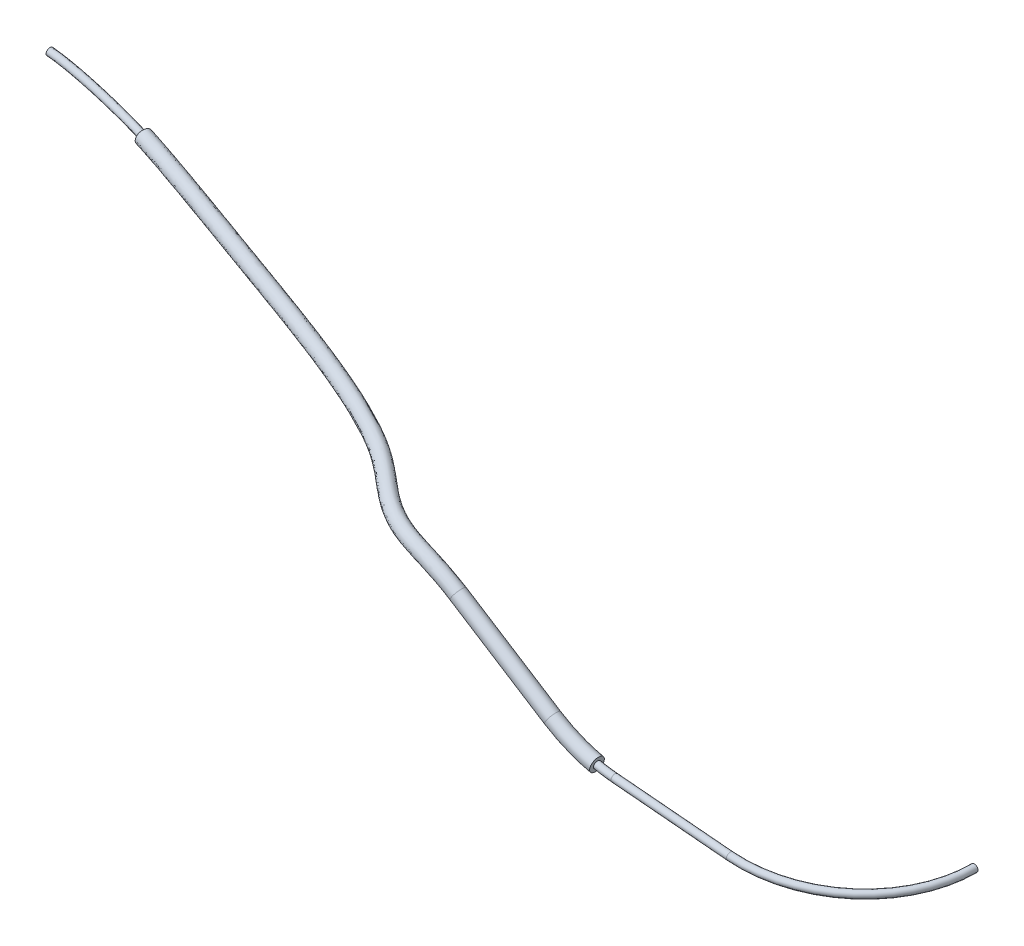
ISO-10303-21;
HEADER;
FILE_DESCRIPTION(('STEP AP214'),'2;1');
FILE_NAME('part.step','',(''),(''),'','','');
FILE_SCHEMA(('AUTOMOTIVE_DESIGN { 1 0 10303 214 1 1 1 1 }'));
ENDSEC;
DATA;
#1=APPLICATION_CONTEXT('core data for automotive mechanical design processes');
#2=APPLICATION_PROTOCOL_DEFINITION('international standard','automotive_design',2000,#1);
#3=PRODUCT_CONTEXT('',#1,'mechanical');
#4=PRODUCT('Part','Part','',(#3));
#5=PRODUCT_RELATED_PRODUCT_CATEGORY('part','',(#4));
#6=PRODUCT_DEFINITION_FORMATION('','',#4);
#7=PRODUCT_DEFINITION_CONTEXT('part definition',#1,'design');
#8=PRODUCT_DEFINITION('design','',#6,#7);
#9=PRODUCT_DEFINITION_SHAPE('','',#8);
#10=(LENGTH_UNIT() NAMED_UNIT(*) SI_UNIT(.MILLI.,.METRE.));
#11=(NAMED_UNIT(*) PLANE_ANGLE_UNIT() SI_UNIT($,.RADIAN.));
#12=(NAMED_UNIT(*) SI_UNIT($,.STERADIAN.) SOLID_ANGLE_UNIT());
#13=UNCERTAINTY_MEASURE_WITH_UNIT(LENGTH_MEASURE(1.E-05),#10,'distance_accuracy_value','');
#14=(GEOMETRIC_REPRESENTATION_CONTEXT(3) GLOBAL_UNCERTAINTY_ASSIGNED_CONTEXT((#13)) GLOBAL_UNIT_ASSIGNED_CONTEXT((#10,
#11,#12)) REPRESENTATION_CONTEXT('',''));
#15=CARTESIAN_POINT('',(0.,0.,0.));
#16=DIRECTION('',(0.,0.,1.));
#17=DIRECTION('',(1.,0.,0.));
#18=AXIS2_PLACEMENT_3D('',#15,#16,#17);
#19=CARTESIAN_POINT('',(-31.2200938866293,22.7983679550577,16.3986439295386));
#20=DIRECTION('',(0.00262026090951332,0.0299534145210183,0.999547861380984));
#21=DIRECTION('',(0.,-0.999551292730131,0.0299535173481338));
#22=AXIS2_PLACEMENT_3D('',#19,#20,#21);
#23=TOROIDAL_SURFACE('',#22,20.,0.5);
#24=CARTESIAN_POINT('',(-35.4178961931824,3.25297513295508,16.9953643203384));
#25=DIRECTION('',(-0.977721470420134,0.209873394056464,-0.00372622418963117));
#26=DIRECTION('',(-0.209874851091096,-0.977728258198304,0.));
#27=AXIS2_PLACEMENT_3D('',#24,#25,#26);
#28=CIRCLE('',#27,0.5);
#29=CARTESIAN_POINT('',(-35.5228412508463,2.76434031240252,17.0102823301084));
#30=VERTEX_POINT('',#29);
#31=EDGE_CURVE('E13',#30,#30,#28,.T.);
#32=CARTESIAN_POINT('',(-32.9622072979749,2.88346369371292,17.));
#33=DIRECTION('',(-0.996195631584374,0.0871450722198903,0.));
#34=DIRECTION('',(0.00759426361221224,0.0868135402595565,0.996195631584374));
#35=AXIS2_PLACEMENT_3D('',#32,#33,#34);
#36=CIRCLE('',#35,0.5);
#37=CARTESIAN_POINT('',(-33.0057601332586,2.3855910871793,17.0150339017616));
#38=VERTEX_POINT('',#37);
#39=EDGE_CURVE('E87',#38,#38,#36,.T.);
#40=CARTESIAN_POINT('',(-31.2200938866293,22.7983679550577,16.3986439295386));
#41=DIRECTION('',(0.00262026090951332,0.0299534145210183,0.999547861380984));
#42=DIRECTION('',(0.,-0.999551292730131,0.0299535173481338));
#43=AXIS2_PLACEMENT_3D('',#40,#41,#42);
#44=CIRCLE('',#43,20.5);
#45=EDGE_CURVE('',#30,#38,#44,.T.);
#46=ORIENTED_EDGE('',*,*,#31,.F.);
#47=ORIENTED_EDGE('',*,*,#39,.T.);
#48=ORIENTED_EDGE('',*,*,#45,.T.);
#49=ORIENTED_EDGE('',*,*,#45,.F.);
#50=EDGE_LOOP('',(#46,#48,#47,#49));
#51=FACE_BOUND('',#50,.T.);
#52=ADVANCED_FACE('F44',(#51),#23,.T.);
#53=CARTESIAN_POINT('',(0.,0.,0.));
#54=DIRECTION('',(0.,0.,1.));
#55=DIRECTION('',(1.,0.,0.));
#56=AXIS2_PLACEMENT_3D('',#53,#54,#55);
#57=PLANE('',#56);
#58=CARTESIAN_POINT('',(0.,0.,0.));
#59=DIRECTION('',(0.,0.,1.));
#60=DIRECTION('',(1.,0.,0.));
#61=AXIS2_PLACEMENT_3D('',#58,#59,#60);
#62=CIRCLE('',#61,0.5);
#63=CARTESIAN_POINT('',(0.5,0.,0.));
#64=VERTEX_POINT('',#63);
#65=EDGE_CURVE('E57',#64,#64,#62,.T.);
#66=ORIENTED_EDGE('',*,*,#65,.F.);
#67=EDGE_LOOP('',(#66));
#68=FACE_BOUND('',#67,.T.);
#69=ADVANCED_FACE('F108',(#68),#57,.F.);
#70=CARTESIAN_POINT('',(-32.9622072979749,2.88346369371292,17.));
#71=DIRECTION('',(0.996195631584374,-0.0871450722198892,0.));
#72=DIRECTION('',(0.0871450722198892,0.996195631584374,0.));
#73=AXIS2_PLACEMENT_3D('',#70,#71,#72);
#74=CYLINDRICAL_SURFACE('',#73,0.5);
#75=CARTESIAN_POINT('',(-16.9353257369343,1.48146622773808,17.));
#76=DIRECTION('',(-0.996195631584374,0.0871450722198898,0.));
#77=DIRECTION('',(0.00759426361221275,0.0868135402595565,0.996195631584374));
#78=AXIS2_PLACEMENT_3D('',#75,#76,#77);
#79=CIRCLE('',#78,0.5);
#80=CARTESIAN_POINT('',(-16.9315286051282,1.52487299786786,17.4980978157922));
#81=VERTEX_POINT('',#80);
#82=EDGE_CURVE('E90',#81,#81,#79,.T.);
#83=ORIENTED_EDGE('',*,*,#82,.T.);
#84=EDGE_LOOP('',(#83));
#85=FACE_BOUND('',#84,.T.);
#86=ORIENTED_EDGE('',*,*,#39,.F.);
#87=EDGE_LOOP('',(#86));
#88=FACE_BOUND('',#87,.T.);
#89=ADVANCED_FACE('F95',(#85,#88),#74,.T.);
#90=CARTESIAN_POINT('',(-16.9353257369344,1.4814662277381,0.));
#91=DIRECTION('',(0.0871450722198882,0.996195631584374,0.));
#92=DIRECTION('',(-0.996195631584374,0.0871450722198882,0.));
#93=AXIS2_PLACEMENT_3D('',#90,#91,#92);
#94=TOROIDAL_SURFACE('',#93,17.,0.5);
#95=ORIENTED_EDGE('',*,*,#65,.T.);
#96=EDGE_LOOP('',(#95));
#97=FACE_BOUND('',#96,.T.);
#98=ORIENTED_EDGE('',*,*,#82,.F.);
#99=EDGE_LOOP('',(#98));
#100=FACE_BOUND('',#99,.T.);
#101=ADVANCED_FACE('F98',(#97,#100),#94,.T.);
#102=CARTESIAN_POINT('',(-119.382838313861,26.2426936084585,-4.02926946825118));
#103=DIRECTION('',(-0.969669931296822,0.138175246355401,-0.201613059183773));
#104=DIRECTION('',(-0.15207214483386,-0.986833741600424,0.0550747601405472));
#105=AXIS2_PLACEMENT_3D('',#102,#103,#104);
#106=PLANE('',#105);
#107=CARTESIAN_POINT('',(-119.382838313861,26.2426936084585,-4.02926946825118));
#108=DIRECTION('',(-0.969669931296822,0.138175246355401,-0.201613059183773));
#109=DIRECTION('',(-0.15207214483386,-0.986833741600424,0.0550747601405472));
#110=AXIS2_PLACEMENT_3D('',#107,#108,#109);
#111=CIRCLE('',#110,1.);
#112=CARTESIAN_POINT('',(-119.534910458695,25.2558598668581,-3.97419470811064));
#113=VERTEX_POINT('',#112);
#114=EDGE_CURVE('E156',#113,#113,#111,.T.);
#115=ORIENTED_EDGE('',*,*,#114,.T.);
#116=EDGE_LOOP('',(#115));
#117=FACE_BOUND('',#116,.T.);
#118=CARTESIAN_POINT('',(-119.471544187037,26.3274949897696,-3.54451480784439));
#119=CARTESIAN_POINT('',(-119.466819369843,26.354921803188,-3.54844216499339));
#120=CARTESIAN_POINT('',(-119.461675585093,26.3819275043064,-3.5546731811375));
#121=CARTESIAN_POINT('',(-119.45068377419,26.4344100960731,-3.5715700709377));
#122=CARTESIAN_POINT('',(-119.444834907974,26.4598851077805,-3.58224127264824));
#123=CARTESIAN_POINT('',(-119.432609350133,26.5085190206295,-3.60770962732206));
#124=CARTESIAN_POINT('',(-119.426232984675,26.531679333736,-3.62250424387579));
#125=CARTESIAN_POINT('',(-119.413129720267,26.5750482607951,-3.65580233159247));
#126=CARTESIAN_POINT('',(-119.406402811111,26.5952567887415,-3.67430591078638));
#127=CARTESIAN_POINT('',(-119.392790167808,26.632145442347,-3.71449513328228));
#128=CARTESIAN_POINT('',(-119.385904444045,26.6488257979695,-3.73618056903729));
#129=CARTESIAN_POINT('',(-119.372168897185,26.6781871480263,-3.78211973111737));
#130=CARTESIAN_POINT('',(-119.365319075505,26.6908679858227,-3.8063735579817));
#131=CARTESIAN_POINT('',(-119.351854716693,26.7118622165262,-3.85674281940411));
#132=CARTESIAN_POINT('',(-119.345240021433,26.7201785985036,-3.88285696593387));
#133=CARTESIAN_POINT('',(-119.332419861928,26.7322295860784,-3.93625715267427));
#134=CARTESIAN_POINT('',(-119.326214955476,26.735958063626,-3.96354470999732));
#135=CARTESIAN_POINT('',(-119.314404247837,26.7387061779324,-4.0184655903126));
#136=CARTESIAN_POINT('',(-119.308798063321,26.7377288462608,-4.04609867926421));
#137=CARTESIAN_POINT('',(-119.298339044967,26.7311000986791,-4.10094495005926));
#138=CARTESIAN_POINT('',(-119.293486245517,26.7254484694733,-4.12815811268307));
#139=CARTESIAN_POINT('',(-119.284671938635,26.7096312674814,-4.18139134159192));
#140=CARTESIAN_POINT('',(-119.280710448605,26.699465606571,-4.20741138457357));
#141=CARTESIAN_POINT('',(-119.273791096865,26.6749082681593,-4.2575207557243));
#142=CARTESIAN_POINT('',(-119.270833290084,26.6605163594461,-4.28160997816911));
#143=CARTESIAN_POINT('',(-119.266007061894,26.6279257143268,-4.3271579640635));
#144=CARTESIAN_POINT('',(-119.264137955619,26.6097293809711,-4.34861837448645));
#145=CARTESIAN_POINT('',(-119.261537472244,26.5700135490356,-4.38834474652832));
#146=CARTESIAN_POINT('',(-119.2608076156,26.5484896514554,-4.40660641027116));
#147=CARTESIAN_POINT('',(-119.260511357879,26.5027790526376,-4.43935897840025));
#148=CARTESIAN_POINT('',(-119.260943403508,26.4785959478396,-4.45385488863163));
#149=CARTESIAN_POINT('',(-119.262956838061,26.4281932944349,-4.4787145486475));
#150=CARTESIAN_POINT('',(-119.264539838437,26.4019709366881,-4.48907247329993));
#151=CARTESIAN_POINT('',(-119.268808680312,26.3483070305193,-4.50531971373629));
#152=CARTESIAN_POINT('',(-119.271492808363,26.3208674351252,-4.51121593194483));
#153=CARTESIAN_POINT('',(-119.277893125098,26.2654623317883,-4.51840504519309));
#154=CARTESIAN_POINT('',(-119.281611028283,26.2374960227575,-4.51969024326083));
#155=CARTESIAN_POINT('',(-119.289971057183,26.1818791910654,-4.5175991127017));
#156=CARTESIAN_POINT('',(-119.294613131061,26.1542286507843,-4.51422304546823));
#157=CARTESIAN_POINT('',(-119.30468119411,26.1000734617112,-4.50291528880637));
#158=CARTESIAN_POINT('',(-119.310105863971,26.0735669800531,-4.49499120082707));
#159=CARTESIAN_POINT('',(-119.321599650403,26.022364528982,-4.47480268811178));
#160=CARTESIAN_POINT('',(-119.327669699377,25.9976712686528,-4.46253192225888));
#161=CARTESIAN_POINT('',(-119.340266195625,25.9508734914073,-4.4340211240222));
#162=CARTESIAN_POINT('',(-119.346791991453,25.9287653954936,-4.41778667767611));
#163=CARTESIAN_POINT('',(-119.360131370921,25.8876974523074,-4.38177600438243));
#164=CARTESIAN_POINT('',(-119.366945321246,25.8687417776064,-4.36199515418336));
#165=CARTESIAN_POINT('',(-119.380650055097,25.834575896167,-4.31949696839705));
#166=CARTESIAN_POINT('',(-119.387540724238,25.8193607359525,-4.29678357780287));
#167=CARTESIAN_POINT('',(-119.401217176634,25.793065350427,-4.24902737926552));
#168=CARTESIAN_POINT('',(-119.408002885458,25.7819879410738,-4.22398299938842));
#169=CARTESIAN_POINT('',(-119.421271596559,25.7642975762442,-4.17229041704457));
#170=CARTESIAN_POINT('',(-119.42775461523,25.7576843787291,-4.14564230161385));
#171=CARTESIAN_POINT('',(-119.440234871558,25.749108651457,-4.09149513420322));
#172=CARTESIAN_POINT('',(-119.446232069472,25.7471465018162,-4.06399601285919));
#173=CARTESIAN_POINT('',(-119.457569616883,25.747929482132,-4.00893079356103));
#174=CARTESIAN_POINT('',(-119.462909995557,25.7506744029114,-3.98136469863748));
#175=CARTESIAN_POINT('',(-119.472786421681,25.7607969281413,-3.92692598369083));
#176=CARTESIAN_POINT('',(-119.477321859957,25.7681780222036,-3.90005390192242));
#177=CARTESIAN_POINT('',(-119.485449131303,25.7873532241589,-3.84782361017474));
#178=CARTESIAN_POINT('',(-119.48904221294,25.7991414420967,-3.82246343181022));
#179=CARTESIAN_POINT('',(-119.495193234415,25.8268082147489,-3.77391834381643));
#180=CARTESIAN_POINT('',(-119.497750390223,25.8426898527132,-3.75073509193046));
#181=CARTESIAN_POINT('',(-119.501753006265,25.8780875007022,-3.70722454162825));
#182=CARTESIAN_POINT('',(-119.503198509807,25.8976033691044,-3.68689713197662));
#183=CARTESIAN_POINT('',(-119.504936992328,25.9397178476323,-3.64967269471282));
#184=CARTESIAN_POINT('',(-119.505229882359,25.9623166955345,-3.63277593194143));
#185=CARTESIAN_POINT('',(-119.504654744714,26.0099528356016,-3.60289472419443));
#186=CARTESIAN_POINT('',(-119.503786751204,26.0349900559836,-3.5899101640941));
#187=CARTESIAN_POINT('',(-119.500913006432,26.0868122030304,-3.56821536879232));
#188=CARTESIAN_POINT('',(-119.498906556303,26.1135981942691,-3.55950776522326));
#189=CARTESIAN_POINT('',(-119.493817782049,26.1680973086232,-3.54663162940509));
#190=CARTESIAN_POINT('',(-119.490736755074,26.1958092776626,-3.54245764938475));
#191=CARTESIAN_POINT('',(-119.482688462076,26.2583573320057,-3.53829916251339));
#192=CARTESIAN_POINT('',(-119.477442825072,26.2932543327975,-3.53961174867761));
#193=CARTESIAN_POINT('',(-119.471544187037,26.3274949897696,-3.54451480784439));
#194=B_SPLINE_CURVE_WITH_KNOTS('',3,(#118,#119,#120,#121,#122,#123,#124,#125,#126,#127,#128,
#129,#130,#131,#132,#133,#134,#135,#136,#137,#138,#139,#140,#141,#142,#143,#144,#145,#146,#147,
#148,#149,#150,#151,#152,#153,#154,#155,#156,#157,#158,#159,#160,#161,#162,#163,#164,#165,#166,
#167,#168,#169,#170,#171,#172,#173,#174,#175,#176,#177,#178,#179,#180,#181,#182,#183,#184,#185,
#186,#187,#188,#189,#190,#191,#192,#193),.UNSPECIFIED.,.T.,.F.,(4,2,2,2,2,2,2,2,2,2,2,2,2,2,2,2,
2,2,2,2,2,2,2,2,2,2,2,2,2,2,2,2,2,2,2,2,2,4),(0.,0.0841885324125921,0.16847838055267,
0.252716494021672,0.336957061450593,0.421192136454235,0.505430510046022,0.589611116043435,
0.673904040187835,0.758142668532792,0.842385141032538,0.926629258210851,1.01087798512468,
1.09507365655716,1.17938160077394,1.26357689358975,1.34789029579714,1.43207299387702,
1.51639614920164,1.60071457606351,1.68489248389278,1.76919370320143,1.85337679523087,
1.93767044086111,2.02185184968721,2.10609044447446,2.19032447167993,2.27456538284256,
2.35880255052645,2.44310319897954,2.52729158321772,2.61154356617685,2.69579226660101,
2.78004746842764,2.86430019062729,2.94860468920082,3.03280777188533,3.13791187622867),.UNSPECIFIED.);
#195=CARTESIAN_POINT('',(-119.471544187037,26.3274949897696,-3.54451480784439));
#196=VERTEX_POINT('',#195);
#197=EDGE_CURVE('E48',#196,#196,#194,.T.);
#198=ORIENTED_EDGE('',*,*,#197,.F.);
#199=EDGE_LOOP('',(#198));
#200=FACE_BOUND('',#199,.T.);
#201=ADVANCED_FACE('F100',(#117,#200),#106,.T.);
#202=CARTESIAN_POINT('',(-35.4178961931824,3.2529751329551,16.9953643203384));
#203=DIRECTION('',(-0.977721470420134,0.209873394056464,-0.00372622418963117));
#204=DIRECTION('',(-0.209874851091096,-0.977728258198304,0.));
#205=AXIS2_PLACEMENT_3D('',#202,#203,#204);
#206=PLANE('',#205);
#207=ORIENTED_EDGE('',*,*,#31,.T.);
#208=EDGE_LOOP('',(#207));
#209=FACE_BOUND('',#208,.T.);
#210=CARTESIAN_POINT('',(-35.4178961931824,3.2529751329551,16.9953643203384));
#211=DIRECTION('',(-0.977721470420134,0.209873394056464,-0.00372622418963117));
#212=DIRECTION('',(-0.209874851091096,-0.977728258198304,0.));
#213=AXIS2_PLACEMENT_3D('',#210,#211,#212);
#214=CIRCLE('',#213,1.);
#215=CARTESIAN_POINT('',(-35.6277710442735,2.2752468747568,16.9953643203384));
#216=VERTEX_POINT('',#215);
#217=EDGE_CURVE('E74',#216,#216,#214,.T.);
#218=ORIENTED_EDGE('',*,*,#217,.F.);
#219=EDGE_LOOP('',(#218));
#220=FACE_BOUND('',#219,.T.);
#221=ADVANCED_FACE('F106',(#209,#220),#206,.F.);
#222=CARTESIAN_POINT('',(-119.534910458695,25.2558598668581,-3.97419470811064));
#223=CARTESIAN_POINT('',(-118.180302410872,25.0628320216093,-3.69254559508604));
#224=CARTESIAN_POINT('',(-116.911292621239,24.9369085907261,-3.34918953168654));
#225=CARTESIAN_POINT('',(-110.675074357738,24.1668910099001,-1.72074700575621));
#226=CARTESIAN_POINT('',(-105.771969511182,23.0492481770787,-0.638934317897517));
#227=CARTESIAN_POINT('',(-95.091437049037,21.148016130084,1.99139766645636));
#228=CARTESIAN_POINT('',(-89.9090718959783,20.3636994157694,3.33908869053257));
#229=CARTESIAN_POINT('',(-80.3876932564328,18.9440091989967,6.35829094113684));
#230=CARTESIAN_POINT('',(-76.0563064818123,18.3082291308345,8.03359684755067));
#231=CARTESIAN_POINT('',(-71.1366114590035,17.4428302986262,10.9809667551709));
#232=CARTESIAN_POINT('',(-69.771685333553,17.1437594227626,12.2272867416542));
#233=CARTESIAN_POINT('',(-66.9086693337093,16.4911890997607,14.3917950398208));
#234=CARTESIAN_POINT('',(-65.4032279331163,16.1363823297736,15.3091411323341));
#235=CARTESIAN_POINT('',(-62.0982172723952,15.4527906076739,16.1831389071892));
#236=CARTESIAN_POINT('',(-60.8141449680491,15.1958142125213,16.3804120865357));
#237=CARTESIAN_POINT('',(-58.8261726902079,14.5863001042488,16.5765391338112));
#238=CARTESIAN_POINT('',(-58.1534622251063,14.3464034471726,16.6248283995411));
#239=CARTESIAN_POINT('',(-57.1468396259899,13.9115447451276,16.6767364353093));
#240=CARTESIAN_POINT('',(-56.8116891644714,13.7541165254987,16.690615168137));
#241=CARTESIAN_POINT('',(-56.1447322803402,13.4111915675095,16.7123087937121));
#242=CARTESIAN_POINT('',(-55.8238137842896,13.2323532128478,16.7199559508013));
#243=CARTESIAN_POINT('',(-55.483901205373,13.0246105238328,16.7252903059039));
#244=CARTESIAN_POINT('',(-119.917607660694,25.4239880052946,-2.01836348312007));
#245=CARTESIAN_POINT('',(-118.639183550315,25.2418161572029,-1.75255447886542));
#246=CARTESIAN_POINT('',(-117.40769273179,25.1194379544474,-1.4203336625501));
#247=CARTESIAN_POINT('',(-111.100588295099,24.3406679520785,0.226619103931146));
#248=CARTESIAN_POINT('',(-106.189361009612,23.2198144685338,1.30981888454054));
#249=CARTESIAN_POINT('',(-95.5599284239121,21.3276786737438,3.92756632331056));
#250=CARTESIAN_POINT('',(-90.4140366250851,20.5491416339808,5.26681603951933));
#251=CARTESIAN_POINT('',(-81.0327752510644,19.1503491301134,8.24158698235467));
#252=CARTESIAN_POINT('',(-76.7900748347615,18.5249353883814,9.9050697010886));
#253=CARTESIAN_POINT('',(-72.2962098911131,17.734442255352,12.5973264777825));
#254=CARTESIAN_POINT('',(-71.0186351674061,17.4568777356871,13.7642124965755));
#255=CARTESIAN_POINT('',(-67.9629164656386,16.7604997036568,16.0743830807272));
#256=CARTESIAN_POINT('',(-66.1580257646632,16.3365071868147,17.172724391082));
#257=CARTESIAN_POINT('',(-62.4349830786988,15.5664509155931,18.1572693085422));
#258=CARTESIAN_POINT('',(-61.0589277982559,15.2892861908154,18.364549071977));
#259=CARTESIAN_POINT('',(-58.9655583716609,14.6472557533028,18.5710866630759));
#260=CARTESIAN_POINT('',(-58.2637748387336,14.3966551759076,18.621329069799));
#261=CARTESIAN_POINT('',(-57.2205388037523,13.9459466518967,18.6751263369385));
#262=CARTESIAN_POINT('',(-56.874362588247,13.7832849343997,18.6894515868088));
#263=CARTESIAN_POINT('',(-56.1874779900889,13.4300839743153,18.7117941435178));
#264=CARTESIAN_POINT('',(-55.8536786218151,13.2437779123994,18.7197057611993));
#265=CARTESIAN_POINT('',(-55.5097882916612,13.0336041608422,18.7251025404041));
#266=CARTESIAN_POINT('',(-119.613463371026,27.3976554884955,-2.12851300340116));
#267=CARTESIAN_POINT('',(-118.381183348787,27.2220590432724,-1.87229824448724));
#268=CARTESIAN_POINT('',(-117.162427652795,27.1006920806569,-1.5444692609852));
#269=CARTESIAN_POINT('',(-110.707695204407,26.3036936812331,0.141032843336374));
#270=CARTESIAN_POINT('',(-105.768740567654,25.1740980717089,1.22965966300267));
#271=CARTESIAN_POINT('',(-95.2234871655519,23.2969469377887,3.82667599172518));
#272=CARTESIAN_POINT('',(-90.0882102086364,22.5196670831411,5.16256837359299));
#273=CARTESIAN_POINT('',(-80.7050832230841,21.120596108867,8.13792525891873));
#274=CARTESIAN_POINT('',(-76.4517047323096,20.4942295117525,9.80018694997114));
#275=CARTESIAN_POINT('',(-71.8714393099697,19.6885381015889,12.5442058337074));
#276=CARTESIAN_POINT('',(-70.5637743385411,19.40429202004,13.7371024355224));
#277=CARTESIAN_POINT('',(-67.4962740284409,18.7052269624722,16.0560405447244));
#278=CARTESIAN_POINT('',(-65.7135776202078,18.2864383012323,17.1386402238569));
#279=CARTESIAN_POINT('',(-62.0347959940613,17.5255367839843,18.1114813865456));
#280=CARTESIAN_POINT('',(-60.5872079599818,17.2364683361858,18.3355546769765));
#281=CARTESIAN_POINT('',(-58.3196998616279,16.5410486619295,18.559474180806));
#282=CARTESIAN_POINT('',(-57.5480064613635,16.2660869648171,18.6149509826857));
#283=CARTESIAN_POINT('',(-56.388545056771,15.7651693830828,18.6747735705326));
#284=CARTESIAN_POINT('',(-56.0017493444237,15.583495909265,18.690806492466));
#285=CARTESIAN_POINT('',(-55.2311848744377,15.1872697608542,18.7158991119855));
#286=CARTESIAN_POINT('',(-54.8325547544385,14.9636404602097,18.7251893271138));
#287=CARTESIAN_POINT('',(-54.4668922333474,14.7401603064432,18.7309277841648));
#288=CARTESIAN_POINT('',(-119.230766169027,27.229527350059,-4.08434422839173));
#289=CARTESIAN_POINT('',(-117.922302209345,27.0430749076788,-3.81228936070964));
#290=CARTESIAN_POINT('',(-116.666027542249,26.9181627169344,-3.47332513012221));
#291=CARTESIAN_POINT('',(-110.282181267027,26.1299167390592,-1.8063332663487));
#292=CARTESIAN_POINT('',(-105.351349069223,25.0035317802482,-0.719093539435382));
#293=CARTESIAN_POINT('',(-94.7549957906768,23.117284394133,1.89050733487098));
#294=CARTESIAN_POINT('',(-89.5832454795121,22.3342248649297,3.23484102460403));
#295=CARTESIAN_POINT('',(-80.06000122847,20.9142561777503,6.25462921770309));
#296=CARTESIAN_POINT('',(-75.7179363793484,20.2775232542057,7.92871409643321));
#297=CARTESIAN_POINT('',(-70.7118408778684,19.3969261448631,10.9278461110958));
#298=CARTESIAN_POINT('',(-69.3168245046943,19.0911737071154,12.2001766806011));
#299=CARTESIAN_POINT('',(-66.4420268965053,18.4359163585762,14.373452503818));
#300=CARTESIAN_POINT('',(-64.9587797886453,18.0863134441932,15.275056965111));
#301=CARTESIAN_POINT('',(-61.6980301877661,17.411876476064,16.1373509851916));
#302=CARTESIAN_POINT('',(-60.3424251297726,17.142996357891,16.3514176915371));
#303=CARTESIAN_POINT('',(-58.1803141801761,16.4800930128759,16.5649266515404));
#304=CARTESIAN_POINT('',(-57.4376938477363,16.2158352360831,16.6184503124268));
#305=CARTESIAN_POINT('',(-56.3148458790086,15.7307674763132,16.6763836689039));
#306=CARTESIAN_POINT('',(-55.9390759206474,15.5543275003637,16.6919700737947));
#307=CARTESIAN_POINT('',(-55.1884391646897,15.1683773540485,16.7164137621793));
#308=CARTESIAN_POINT('',(-54.8026899169131,14.9522157606581,16.7254395167159));
#309=CARTESIAN_POINT('',(-54.4410051470592,14.7311666694338,16.7311155496646));
#310=CARTESIAN_POINT('',(-118.848068967028,27.0613992116224,-6.04017545338229));
#311=CARTESIAN_POINT('',(-117.463421069902,26.8640907720852,-5.75228047693203));
#312=CARTESIAN_POINT('',(-116.169627431703,26.735633353212,-5.40218099925921));
#313=CARTESIAN_POINT('',(-109.856667329648,25.9561397968853,-3.75369937603378));
#314=CARTESIAN_POINT('',(-104.933957570793,24.8329654887876,-2.66784674187343));
#315=CARTESIAN_POINT('',(-94.2865044158017,22.9376218504773,-0.0456613219832172));
#316=CARTESIAN_POINT('',(-89.0782807503877,22.1487826467183,1.30711367561508));
#317=CARTESIAN_POINT('',(-79.4149192338559,20.7079162466337,4.37133317648745));
#318=CARTESIAN_POINT('',(-74.9841680263872,20.0608169966588,6.05724124289528));
#319=CARTESIAN_POINT('',(-69.5522424457671,19.1053141881372,9.31148638848411));
#320=CARTESIAN_POINT('',(-68.0698746708475,18.7780553941908,10.6632509256799));
#321=CARTESIAN_POINT('',(-65.3877797645696,18.1666057546801,12.6908644629115));
#322=CARTESIAN_POINT('',(-64.2039819570828,17.8861885871542,13.411473706365));
#323=CARTESIAN_POINT('',(-61.3612643814708,17.2982161681438,14.1632205838375));
#324=CARTESIAN_POINT('',(-60.0976422995634,17.0495243795963,14.3672807060976));
#325=CARTESIAN_POINT('',(-58.0409284987243,16.4191373638223,14.5703791222747));
#326=CARTESIAN_POINT('',(-57.327381234109,16.1655835073491,14.6219496421679));
#327=CARTESIAN_POINT('',(-56.2411467012461,15.6963655695436,14.6779937672752));
#328=CARTESIAN_POINT('',(-55.8764024968711,15.5251590914625,14.6931336551235));
#329=CARTESIAN_POINT('',(-55.1456934549416,15.1494849472428,14.7169284123731));
#330=CARTESIAN_POINT('',(-54.7728250793876,14.9407910611064,14.725689706318));
#331=CARTESIAN_POINT('',(-54.415118060771,14.7221730324244,14.7313033151643));
#332=CARTESIAN_POINT('',(-119.152213256696,25.0877317284216,-5.9300259331012));
#333=CARTESIAN_POINT('',(-117.72142127143,24.8838478860158,-5.63253671130664));
#334=CARTESIAN_POINT('',(-116.414892510689,24.7543792270047,-5.27804540082298));
#335=CARTESIAN_POINT('',(-110.249560420377,23.9931140677216,-3.66811311544358));
#336=CARTESIAN_POINT('',(-105.354578012752,22.8786818856236,-2.58768752033557));
#337=CARTESIAN_POINT('',(-94.6229456741619,20.9683535864243,0.0552290096021645));
#338=CARTESIAN_POINT('',(-89.4041071668715,20.178257197558,1.41136134154581));
#339=CARTESIAN_POINT('',(-79.7426112618012,18.73766926788,4.47499489991901));
#340=CARTESIAN_POINT('',(-75.3225381288631,18.0915228732877,6.16212399401274));
#341=CARTESIAN_POINT('',(-69.9770130268939,17.1512183419003,9.36460703255921));
#342=CARTESIAN_POINT('',(-68.5247354996999,16.830641109838,10.690360986733));
#343=CARTESIAN_POINT('',(-65.85442220178,16.2218784958647,12.7092069989144));
#344=CARTESIAN_POINT('',(-64.6484301015695,15.9362574727326,13.4455578735862));
#345=CARTESIAN_POINT('',(-61.7614514660916,15.3391302997547,14.2090085058363));
#346=CARTESIAN_POINT('',(-60.5693621378424,15.1023422342271,14.3962751010943));
#347=CARTESIAN_POINT('',(-58.6867870087548,14.5253444551949,14.5819916045465));
#348=CARTESIAN_POINT('',(-58.043149611479,14.2961517184376,14.6283277292832));
#349=CARTESIAN_POINT('',(-57.0731404482274,13.8771428383585,14.67834653368));
#350=CARTESIAN_POINT('',(-56.7490157406958,13.7249481165976,14.6917787494653));
#351=CARTESIAN_POINT('',(-56.1019865705915,13.3922991607036,14.7128234439064));
#352=CARTESIAN_POINT('',(-55.7939489467642,13.2209285132961,14.7202061404034));
#353=CARTESIAN_POINT('',(-55.4580141190847,13.0156168868234,14.7254780714036));
#354=CARTESIAN_POINT('',(-119.534910458695,25.2558598668581,-3.97419470811064));
#355=CARTESIAN_POINT('',(-118.180302410872,25.0628320216093,-3.69254559508604));
#356=CARTESIAN_POINT('',(-116.911292621239,24.9369085907261,-3.34918953168654));
#357=CARTESIAN_POINT('',(-110.675074357738,24.1668910099001,-1.72074700575621));
#358=CARTESIAN_POINT('',(-105.771969511182,23.0492481770787,-0.638934317897517));
#359=CARTESIAN_POINT('',(-95.091437049037,21.148016130084,1.99139766645636));
#360=CARTESIAN_POINT('',(-89.9090718959783,20.3636994157694,3.33908869053257));
#361=CARTESIAN_POINT('',(-80.3876932564328,18.9440091989967,6.35829094113684));
#362=CARTESIAN_POINT('',(-76.0563064818123,18.3082291308345,8.03359684755067));
#363=CARTESIAN_POINT('',(-71.1366114590035,17.4428302986262,10.9809667551709));
#364=CARTESIAN_POINT('',(-69.771685333553,17.1437594227626,12.2272867416542));
#365=CARTESIAN_POINT('',(-66.9086693337093,16.4911890997607,14.3917950398208));
#366=CARTESIAN_POINT('',(-65.4032279331163,16.1363823297736,15.3091411323341));
#367=CARTESIAN_POINT('',(-62.0982172723952,15.4527906076739,16.1831389071892));
#368=CARTESIAN_POINT('',(-60.8141449680491,15.1958142125213,16.3804120865357));
#369=CARTESIAN_POINT('',(-58.8261726902079,14.5863001042488,16.5765391338112));
#370=CARTESIAN_POINT('',(-58.1534622251063,14.3464034471726,16.6248283995411));
#371=CARTESIAN_POINT('',(-57.1468396259899,13.9115447451276,16.6767364353093));
#372=CARTESIAN_POINT('',(-56.8116891644714,13.7541165254987,16.690615168137));
#373=CARTESIAN_POINT('',(-56.1447322803402,13.4111915675095,16.7123087937121));
#374=CARTESIAN_POINT('',(-55.8238137842896,13.2323532128478,16.7199559508013));
#375=CARTESIAN_POINT('',(-55.483901205373,13.0246105238328,16.7252903059039));
#376=(BOUNDED_SURFACE() B_SPLINE_SURFACE(3,3,((#222,#223,#224,#225,#226,#227,#228,#229,#230,
#231,#232,#233,#234,#235,#236,#237,#238,#239,#240,#241,#242,#243),(#244,#245,#246,#247,#248,
#249,#250,#251,#252,#253,#254,#255,#256,#257,#258,#259,#260,#261,#262,#263,#264,#265),(#266,
#267,#268,#269,#270,#271,#272,#273,#274,#275,#276,#277,#278,#279,#280,#281,#282,#283,#284,#285,
#286,#287),(#288,#289,#290,#291,#292,#293,#294,#295,#296,#297,#298,#299,#300,#301,#302,#303,
#304,#305,#306,#307,#308,#309),(#310,#311,#312,#313,#314,#315,#316,#317,#318,#319,#320,#321,
#322,#323,#324,#325,#326,#327,#328,#329,#330,#331),(#332,#333,#334,#335,#336,#337,#338,#339,
#340,#341,#342,#343,#344,#345,#346,#347,#348,#349,#350,#351,#352,#353),(#354,#355,#356,#357,
#358,#359,#360,#361,#362,#363,#364,#365,#366,#367,#368,#369,#370,#371,#372,#373,#374,#375)),
.UNSPECIFIED.,.T.,.F.,.F.) B_SPLINE_SURFACE_WITH_KNOTS((4,3,4),(4,2,2,2,2,2,2,2,2,2,4),(0.,0.5,
1.),(0.,0.0438527301966196,0.22066713525533,0.350621468631585,0.480575802007841,
0.570809749951039,0.661043697894237,0.709161986248246,0.733221130425251,0.745250702513753,
0.757280274602256),
.UNSPECIFIED.) GEOMETRIC_REPRESENTATION_ITEM() RATIONAL_B_SPLINE_SURFACE(((1.,1.,1.,1.,1.,1.,1.,
1.,1.,1.,1.,1.,1.,1.,1.,1.,1.,1.,1.,1.,1.,1.),(0.333333333333333,0.333333333333333,
0.333333333333333,0.333333333333333,0.333333333333333,0.333333333333333,0.333333333333333,
0.333333333333333,0.333333333333333,0.333333333333333,0.333333333333333,0.333333333333333,
0.333333333333333,0.333333333333333,0.333333333333333,0.333333333333333,0.333333333333333,
0.333333333333333,0.333333333333333,0.333333333333333,0.333333333333333,0.333333333333333),
(0.333333333333333,0.333333333333333,0.333333333333333,0.333333333333333,0.333333333333333,
0.333333333333333,0.333333333333333,0.333333333333333,0.333333333333333,0.333333333333333,
0.333333333333333,0.333333333333333,0.333333333333333,0.333333333333333,0.333333333333333,
0.333333333333333,0.333333333333333,0.333333333333333,0.333333333333333,0.333333333333333,
0.333333333333333,0.333333333333333),(1.,1.,1.,1.,1.,1.,1.,1.,1.,1.,1.,1.,1.,1.,1.,1.,1.,1.,1.,
1.,1.,1.),(0.333333333333333,0.333333333333333,0.333333333333333,0.333333333333333,
0.333333333333333,0.333333333333333,0.333333333333333,0.333333333333333,0.333333333333333,
0.333333333333333,0.333333333333333,0.333333333333333,0.333333333333333,0.333333333333333,
0.333333333333333,0.333333333333333,0.333333333333333,0.333333333333333,0.333333333333333,
0.333333333333333,0.333333333333333,0.333333333333333),(0.333333333333333,0.333333333333333,
0.333333333333333,0.333333333333333,0.333333333333333,0.333333333333333,0.333333333333333,
0.333333333333333,0.333333333333333,0.333333333333333,0.333333333333333,0.333333333333333,
0.333333333333333,0.333333333333333,0.333333333333333,0.333333333333333,0.333333333333333,
0.333333333333333,0.333333333333333,0.333333333333333,0.333333333333333,0.333333333333333),(1.,
1.,1.,1.,1.,1.,1.,1.,1.,1.,1.,1.,1.,1.,1.,1.,1.,1.,1.,1.,1.,1.))) REPRESENTATION_ITEM('') SURFACE());
#377=CARTESIAN_POINT('',(-54.9624531762161,13.8778885966333,16.7282029277842));
#378=DIRECTION('',(-0.853184867176677,0.521436773828953,-0.013389298695971));
#379=DIRECTION('',(-0.521448029156878,-0.853278072800531,-0.00291262188033329));
#380=AXIS2_PLACEMENT_3D('',#377,#378,#379);
#381=CIRCLE('',#380,1.);
#382=CARTESIAN_POINT('',(-55.483901205373,13.0246105238328,16.7252903059039));
#383=VERTEX_POINT('',#382);
#384=EDGE_CURVE('E82',#383,#383,#381,.T.);
#385=ORIENTED_EDGE('',*,*,#384,.T.);
#386=EDGE_LOOP('',(#385));
#387=FACE_BOUND('',#386,.T.);
#388=ORIENTED_EDGE('',*,*,#114,.F.);
#389=EDGE_LOOP('',(#388));
#390=FACE_BOUND('',#389,.T.);
#391=ADVANCED_FACE('F133',(#387,#390),#376,.F.);
#392=CARTESIAN_POINT('',(-54.9624531762161,13.8778885966333,16.7282029277842));
#393=DIRECTION('',(0.853184867176676,-0.521436773828955,0.0133892986959713));
#394=DIRECTION('',(0.521483519964995,0.853261354102551,0.));
#395=AXIS2_PLACEMENT_3D('',#392,#393,#394);
#396=CYLINDRICAL_SURFACE('',#395,1.);
#397=CARTESIAN_POINT('',(-41.6521352334316,5.74308743719601,16.9370859372357));
#398=DIRECTION('',(-0.853184867176675,0.521436773828955,-0.0133892986959707));
#399=DIRECTION('',(-0.521448029156881,-0.85327807280053,-0.0029126218803334));
#400=AXIS2_PLACEMENT_3D('',#397,#398,#399);
#401=CIRCLE('',#400,1.);
#402=CARTESIAN_POINT('',(-42.1735832625885,4.88980936439548,16.9341733153553));
#403=VERTEX_POINT('',#402);
#404=EDGE_CURVE('E78',#403,#403,#401,.T.);
#405=ORIENTED_EDGE('',*,*,#404,.T.);
#406=EDGE_LOOP('',(#405));
#407=FACE_BOUND('',#406,.T.);
#408=ORIENTED_EDGE('',*,*,#384,.F.);
#409=EDGE_LOOP('',(#408));
#410=FACE_BOUND('',#409,.T.);
#411=ADVANCED_FACE('F137',(#407,#410),#396,.T.);
#412=CARTESIAN_POINT('',(-31.2200938866293,22.7983679550577,16.3986439295387));
#413=DIRECTION('',(0.00262026090951332,0.0299534145210183,0.999547861380984));
#414=DIRECTION('',(0.,-0.99955129273013,0.0299535173481338));
#415=AXIS2_PLACEMENT_3D('',#412,#413,#414);
#416=TOROIDAL_SURFACE('',#415,20.,1.);
#417=ORIENTED_EDGE('',*,*,#217,.T.);
#418=EDGE_LOOP('',(#417));
#419=FACE_BOUND('',#418,.T.);
#420=ORIENTED_EDGE('',*,*,#404,.F.);
#421=EDGE_LOOP('',(#420));
#422=FACE_BOUND('',#421,.T.);
#423=ADVANCED_FACE('F75',(#419,#422),#416,.T.);
#424=CARTESIAN_POINT('',(-133.358280150891,29.0882881252347,-4.91694367651554));
#425=DIRECTION('',(-0.991882354724123,0.121222307745948,0.038399824109951));
#426=DIRECTION('',(0.0534801616337806,0.123711236100587,0.990876078212655));
#427=AXIS2_PLACEMENT_3D('',#424,#425,#426);
#428=PLANE('',#427);
#429=CARTESIAN_POINT('',(-133.358280150891,29.0882881252347,-4.91694367651554));
#430=DIRECTION('',(-0.991882354724123,0.121222307745948,0.038399824109951));
#431=DIRECTION('',(0.0534801616337806,0.123711236100587,0.990876078212655));
#432=AXIS2_PLACEMENT_3D('',#429,#430,#431);
#433=CIRCLE('',#432,0.5);
#434=CARTESIAN_POINT('',(-133.331540070074,29.150143743285,-4.42150563740921));
#435=VERTEX_POINT('',#434);
#436=EDGE_CURVE('E62',#435,#435,#433,.T.);
#437=ORIENTED_EDGE('',*,*,#436,.T.);
#438=EDGE_LOOP('',(#437));
#439=FACE_BOUND('',#438,.T.);
#440=ADVANCED_FACE('F46',(#439),#428,.T.);
#441=CARTESIAN_POINT('',(-133.331540070074,29.150143743285,-4.42150563740921));
#442=CARTESIAN_POINT('',(-131.8307944133,28.9667310059274,-4.47960564435705));
#443=CARTESIAN_POINT('',(-129.678346455094,28.4685379222218,-4.50832817364944));
#444=CARTESIAN_POINT('',(-124.961170367855,27.3747307228374,-4.31945446665865));
#445=CARTESIAN_POINT('',(-122.389572676116,26.7791857188497,-4.10073808775127));
#446=CARTESIAN_POINT('',(-118.542595352282,26.1779155239411,-3.37548413355533));
#447=CARTESIAN_POINT('',(-117.096068927344,26.0393952157419,-2.98294649686513));
#448=CARTESIAN_POINT('',(-110.521327079811,25.2275784568176,-1.26610660242477));
#449=CARTESIAN_POINT('',(-105.604109637775,24.102012849105,-0.182515332118688));
#450=CARTESIAN_POINT('',(-94.9974808421499,22.2139363291103,2.42961613335526));
#451=CARTESIAN_POINT('',(-89.8207091631601,21.4313234601773,3.77727427749437));
#452=CARTESIAN_POINT('',(-80.3469222787063,20.0188510893161,6.78445041947258));
#453=CARTESIAN_POINT('',(-76.0523977547698,19.3878576548582,8.45103661022456));
#454=CARTESIAN_POINT('',(-71.206394015446,18.5354214932456,11.3542583793894));
#455=CARTESIAN_POINT('',(-69.8491361951403,18.2386969042843,12.5923187942099));
#456=CARTESIAN_POINT('',(-66.9323278214781,17.5739461816244,14.7982565853874));
#457=CARTESIAN_POINT('',(-65.3725510544937,17.2062933989935,15.7519923147054));
#458=CARTESIAN_POINT('',(-61.9728080732208,16.5031071104536,16.651047073459));
#459=CARTESIAN_POINT('',(-60.6379303752223,16.237123665334,16.8582294905195));
#460=CARTESIAN_POINT('',(-58.5329912334131,15.5926089526126,17.0664994361201));
#461=CARTESIAN_POINT('',(-57.8161991705788,15.3376446551112,17.118188961284));
#462=CARTESIAN_POINT('',(-56.7377050933239,14.8722795338467,17.1739685553897));
#463=CARTESIAN_POINT('',(-56.3776578631155,14.703363463537,17.1889305435736));
#464=CARTESIAN_POINT('',(-55.6596355510902,14.3344379435271,17.2123527643654));
#465=CARTESIAN_POINT('',(-55.300191818945,14.1335326100947,17.2208359554475));
#466=CARTESIAN_POINT('',(-54.9462398197502,13.9172095180535,17.226390635592));
#467=CARTESIAN_POINT('',(-133.21617427489,30.1350298697825,-4.55069561819036));
#468=CARTESIAN_POINT('',(-131.612604016438,29.9390504815081,-4.612776385128));
#469=CARTESIAN_POINT('',(-129.453265344997,29.4340118629995,-4.6395304701705));
#470=CARTESIAN_POINT('',(-124.728429948903,28.3384313415615,-4.45033033883816));
#471=CARTESIAN_POINT('',(-122.169907107425,27.7469924416982,-4.23079144256039));
#472=CARTESIAN_POINT('',(-118.392039822158,27.156523922794,-3.51856651154954));
#473=CARTESIAN_POINT('',(-116.954432835857,27.0186011936379,-3.12915151270197));
#474=CARTESIAN_POINT('',(-110.306523138558,26.1977500115194,-1.3932056613454));
#475=CARTESIAN_POINT('',(-105.376652356642,25.0680794633081,-0.307178705940002));
#476=CARTESIAN_POINT('',(-94.8096687151054,23.1870601412177,2.29518920475832));
#477=CARTESIAN_POINT('',(-89.6364841733124,22.4048012783516,3.64156773909853));
#478=CARTESIAN_POINT('',(-80.1555912654069,20.9912691211826,6.65099709961646));
#479=CARTESIAN_POINT('',(-75.851837290947,20.3593386305501,8.31754162208667));
#480=CARTESIAN_POINT('',(-70.9444524760196,19.49610522769,11.2575365135628));
#481=CARTESIAN_POINT('',(-69.5684110873204,19.1951197774746,12.5119996576692));
#482=CARTESIAN_POINT('',(-66.6540340324832,18.5309173839143,14.7160303900326));
#483=CARTESIAN_POINT('',(-65.1182090349142,18.1688400472153,15.6540704410493));
#484=CARTESIAN_POINT('',(-61.7588429930905,17.4740051734885,16.5424480445061));
#485=CARTESIAN_POINT('',(-60.3925782740406,17.2030221847986,16.7575239404793));
#486=CARTESIAN_POINT('',(-58.2056279854305,16.533407944588,16.974004230759));
#487=CARTESIAN_POINT('',(-57.4553040797108,16.266805541463,17.0282226926959));
#488=CARTESIAN_POINT('',(-56.3204371388067,15.7771176129094,17.0869324029566));
#489=CARTESIAN_POINT('',(-55.9405936548086,15.5989495695731,17.1027298301952));
#490=CARTESIAN_POINT('',(-55.1816282598626,15.2089888887854,17.127500940859));
#491=CARTESIAN_POINT('',(-54.7903153029187,14.9897445263527,17.1366631616814));
#492=CARTESIAN_POINT('',(-54.4256400783853,14.7668677737384,17.1423861247767));
#493=CARTESIAN_POINT('',(-133.269654436524,30.0113186336819,-5.54157169640302));
#494=CARTESIAN_POINT('',(-131.655001687869,29.8139848059595,-5.60408151198152));
#495=CARTESIAN_POINT('',(-129.475792177194,29.3046071537007,-5.63136283494447));
#496=CARTESIAN_POINT('',(-124.689867797239,28.1948818842455,-5.43971953952759));
#497=CARTESIAN_POINT('',(-122.091653642319,27.5928299459864,-5.21910463265194));
#498=CARTESIAN_POINT('',(-118.181535713781,26.9816910691079,-4.48194706002352));
#499=CARTESIAN_POINT('',(-116.716584204209,26.8414283558248,-4.08420982541105));
#500=CARTESIAN_POINT('',(-110.112006058512,26.0259274291994,-2.35957897369058));
#501=CARTESIAN_POINT('',(-105.186881829497,24.898165938025,-1.27434923938611));
#502=CARTESIAN_POINT('',(-94.5908340409663,23.0119729287028,1.33517640094908));
#503=CARTESIAN_POINT('',(-89.398903907141,22.2267652715084,2.68593809099509));
#504=CARTESIAN_POINT('',(-79.8481751989554,20.8028187873863,5.7175352307329));
#505=CARTESIAN_POINT('',(-75.5006121361512,20.1657393193819,7.39016408735091));
#506=CARTESIAN_POINT('',(-70.3854179274911,19.2659511754255,10.4546567780878));
#507=CARTESIAN_POINT('',(-68.9670839446574,18.9545297782107,11.747620572728));
#508=CARTESIAN_POINT('',(-66.148873331061,18.3121878403402,13.8789382112732));
#509=CARTESIAN_POINT('',(-64.7607467747392,17.9842511531376,14.7274994232054));
#510=CARTESIAN_POINT('',(-61.6085185958562,17.332260091304,15.5610997918938));
#511=CARTESIAN_POINT('',(-60.2908434824494,17.0717671796356,15.7705093852498));
#512=CARTESIAN_POINT('',(-58.1640327182235,16.4206660723212,15.9810273940736));
#513=CARTESIAN_POINT('',(-57.4312593543744,16.1604553931795,16.0340396848975));
#514=CARTESIAN_POINT('',(-56.3197475533563,15.68086079362,16.091539898365));
#515=CARTESIAN_POINT('',(-55.9471864227277,15.5061341460209,16.1070388528442));
#516=CARTESIAN_POINT('',(-55.2018374024342,15.1231845407196,16.1313644571127));
#517=CARTESIAN_POINT('',(-54.8198004681731,14.9093049123727,16.1403339086995));
#518=CARTESIAN_POINT('',(-54.4580667913171,14.688225930898,16.1460107091611));
#519=CARTESIAN_POINT('',(-133.385020231708,29.0264325071844,-5.41238171562186));
#520=CARTESIAN_POINT('',(-131.87319208473,28.8416653303788,-5.47091077121057));
#521=CARTESIAN_POINT('',(-129.700873287292,28.3391332129231,-5.50016053842288));
#522=CARTESIAN_POINT('',(-124.922608216192,27.2311812655213,-5.30884366734862));
#523=CARTESIAN_POINT('',(-122.31131921101,26.6250232231379,-5.08905127784282));
#524=CARTESIAN_POINT('',(-118.332091243905,26.003082670255,-4.33886468202932));
#525=CARTESIAN_POINT('',(-116.858220295695,25.8622223779288,-3.93800480957388));
#526=CARTESIAN_POINT('',(-110.326809999765,25.0557558744976,-2.2324799147711));
#527=CARTESIAN_POINT('',(-105.41433911063,23.9320993238218,-1.14968586556437));
#528=CARTESIAN_POINT('',(-94.7786461680109,22.0388491165954,1.4696033295457));
#529=CARTESIAN_POINT('',(-89.5831288969887,21.2532874533341,2.82164462939202));
#530=CARTESIAN_POINT('',(-80.0395062122548,19.8304007555198,5.85098855058793));
#531=CARTESIAN_POINT('',(-75.7011725999739,19.19425834369,7.5236590754888));
#532=CARTESIAN_POINT('',(-70.6473594669174,18.3052674409811,10.5513786439144));
#533=CARTESIAN_POINT('',(-69.2478090524773,17.9981069050203,11.8279397092687));
#534=CARTESIAN_POINT('',(-66.4271671200559,17.3552166380502,13.9611644066279));
#535=CARTESIAN_POINT('',(-65.0150887943187,17.0217045049167,14.8254212968606));
#536=CARTESIAN_POINT('',(-61.8224836759864,16.3613620282686,15.6696988208472));
#537=CARTESIAN_POINT('',(-60.5361955836311,16.1058686601723,15.8712149352887));
#538=CARTESIAN_POINT('',(-58.4913959662061,15.4798670803452,16.0735225994353));
#539=CARTESIAN_POINT('',(-57.7921544452424,15.231294506828,16.1240059534856));
#540=CARTESIAN_POINT('',(-56.7370155078735,14.7760227145571,16.1785760507981));
#541=CARTESIAN_POINT('',(-56.3842506310346,14.6105480399849,16.1932395662227));
#542=CARTESIAN_POINT('',(-55.6798446936618,14.2486335954614,16.2162162806191));
#543=CARTESIAN_POINT('',(-55.3296769841994,14.0530929961147,16.2245067024656));
#544=CARTESIAN_POINT('',(-54.978666532682,13.8385676752131,16.2300152199764));
#545=CARTESIAN_POINT('',(-133.500386026893,28.041546380687,-5.28319173484071));
#546=CARTESIAN_POINT('',(-132.091382481592,27.8693458547981,-5.33774003043962));
#547=CARTESIAN_POINT('',(-129.925954397389,27.3736592721455,-5.36895824190129));
#548=CARTESIAN_POINT('',(-125.155348635145,26.2674806467971,-5.17796779516964));
#549=CARTESIAN_POINT('',(-122.530984779701,25.6572165002894,-4.95899792303369));
#550=CARTESIAN_POINT('',(-118.482646774028,25.0244742714021,-4.19578230403511));
#551=CARTESIAN_POINT('',(-116.999856387182,24.8830164000328,-3.79179979373671));
#552=CARTESIAN_POINT('',(-110.541613941018,24.0855843197958,-2.10538085585162));
#553=CARTESIAN_POINT('',(-105.641796391763,22.9660327096187,-1.02502249174262));
#554=CARTESIAN_POINT('',(-94.9664582950554,21.065725304488,1.60403025814232));
#555=CARTESIAN_POINT('',(-89.7673538868364,20.2798096351599,2.95735116778896));
#556=CARTESIAN_POINT('',(-80.2308372255542,18.8579827236532,5.98444187044297));
#557=CARTESIAN_POINT('',(-75.9017330637967,18.2227773679981,7.65715406362668));
#558=CARTESIAN_POINT('',(-70.9093010063438,17.3445837065366,10.6481005097409));
#559=CARTESIAN_POINT('',(-69.5285341602972,17.04168403183,11.9082588458094));
#560=CARTESIAN_POINT('',(-66.7054609090509,16.3982454357603,14.0433906019827));
#561=CARTESIAN_POINT('',(-65.2694308138981,16.0591578566959,14.9233431705157));
#562=CARTESIAN_POINT('',(-62.0364487561167,15.3904639652331,15.7782978498006));
#563=CARTESIAN_POINT('',(-60.7815476848128,15.139970140709,15.9719204853275));
#564=CARTESIAN_POINT('',(-58.8187592141886,14.5390680883692,16.166017804797));
#565=CARTESIAN_POINT('',(-58.1530495361104,14.3021336204766,16.2139722220738));
#566=CARTESIAN_POINT('',(-57.1542834623908,13.8711846354943,16.2656122032313));
#567=CARTESIAN_POINT('',(-56.8213148393415,13.7149619339488,16.2794402796012));
#568=CARTESIAN_POINT('',(-56.1578519848894,13.3740826502031,16.3010681041255));
#569=CARTESIAN_POINT('',(-55.8395535002257,13.1968810798567,16.3086794962318));
#570=CARTESIAN_POINT('',(-55.4992662740468,12.9889094195282,16.3140197307917));
#571=CARTESIAN_POINT('',(-133.446905865259,28.1652576167876,-4.29231565662805));
#572=CARTESIAN_POINT('',(-132.048984810162,27.9944115303467,-4.3464349035861));
#573=CARTESIAN_POINT('',(-129.903427565191,27.5030639814442,-4.37712587712838));
#574=CARTESIAN_POINT('',(-125.193910786808,26.4110301041132,-4.18857859447914));
#575=CARTESIAN_POINT('',(-122.609238244807,25.8113789960012,-3.97068473294215));
#576=CARTESIAN_POINT('',(-118.693150882405,25.1993071250882,-3.23240175556113));
#577=CARTESIAN_POINT('',(-117.23770501883,25.060189237846,-2.83674148102829));
#578=CARTESIAN_POINT('',(-110.736131021065,24.2574069021158,-1.13900754350413));
#579=CARTESIAN_POINT('',(-105.831566918908,23.1359462349019,-0.0578519582973742));
#580=CARTESIAN_POINT('',(-95.1852929691945,21.2408125170029,2.5640430619522));
#581=CARTESIAN_POINT('',(-90.0049341530079,20.4578456420031,3.91298081589022));
#582=CARTESIAN_POINT('',(-80.5382532920057,19.0464330574495,6.91790373932871));
#583=CARTESIAN_POINT('',(-76.2529582185925,18.4163766791664,8.58453159836245));
#584=CARTESIAN_POINT('',(-71.4683355548723,17.5747377588011,11.450980245216));
#585=CARTESIAN_POINT('',(-70.1298613029602,17.282274031094,12.6726379307506));
#586=CARTESIAN_POINT('',(-67.2106216104731,16.6169749793344,14.8804827807421));
#587=CARTESIAN_POINT('',(-65.6268930740732,16.2437467507717,15.8499141883616));
#588=CARTESIAN_POINT('',(-62.1867731533511,15.5322090474187,16.7596461024119));
#589=CARTESIAN_POINT('',(-60.883282476404,15.2712251458694,16.9589350405596));
#590=CARTESIAN_POINT('',(-58.8603544813957,14.6518099606372,17.1589946414811));
#591=CARTESIAN_POINT('',(-58.1770942614468,14.4084837687594,17.2081552298721));
#592=CARTESIAN_POINT('',(-57.1549730478412,13.967441454784,17.2610047078228));
#593=CARTESIAN_POINT('',(-56.8147220714224,13.807777357501,17.2751312569521));
#594=CARTESIAN_POINT('',(-56.1376428423179,13.4598869982689,17.2972045878718));
#595=CARTESIAN_POINT('',(-55.8100683349713,13.2773206938367,17.3050087492137));
#596=CARTESIAN_POINT('',(-55.4668395611151,13.0675512623686,17.3103951464073));
#597=CARTESIAN_POINT('',(-133.331540070074,29.150143743285,-4.42150563740921));
#598=CARTESIAN_POINT('',(-131.8307944133,28.9667310059274,-4.47960564435705));
#599=CARTESIAN_POINT('',(-129.678346455094,28.4685379222218,-4.50832817364944));
#600=CARTESIAN_POINT('',(-124.961170367855,27.3747307228374,-4.31945446665865));
#601=CARTESIAN_POINT('',(-122.389572676116,26.7791857188497,-4.10073808775127));
#602=CARTESIAN_POINT('',(-118.542595352282,26.1779155239411,-3.37548413355533));
#603=CARTESIAN_POINT('',(-117.096068927344,26.0393952157419,-2.98294649686513));
#604=CARTESIAN_POINT('',(-110.521327079811,25.2275784568176,-1.26610660242477));
#605=CARTESIAN_POINT('',(-105.604109637775,24.102012849105,-0.182515332118688));
#606=CARTESIAN_POINT('',(-94.9974808421499,22.2139363291103,2.42961613335526));
#607=CARTESIAN_POINT('',(-89.8207091631601,21.4313234601773,3.77727427749437));
#608=CARTESIAN_POINT('',(-80.3469222787063,20.0188510893161,6.78445041947258));
#609=CARTESIAN_POINT('',(-76.0523977547698,19.3878576548582,8.45103661022456));
#610=CARTESIAN_POINT('',(-71.206394015446,18.5354214932456,11.3542583793894));
#611=CARTESIAN_POINT('',(-69.8491361951403,18.2386969042843,12.5923187942099));
#612=CARTESIAN_POINT('',(-66.9323278214781,17.5739461816244,14.7982565853874));
#613=CARTESIAN_POINT('',(-65.3725510544937,17.2062933989935,15.7519923147054));
#614=CARTESIAN_POINT('',(-61.9728080732208,16.5031071104536,16.651047073459));
#615=CARTESIAN_POINT('',(-60.6379303752223,16.237123665334,16.8582294905195));
#616=CARTESIAN_POINT('',(-58.5329912334131,15.5926089526126,17.0664994361201));
#617=CARTESIAN_POINT('',(-57.8161991705788,15.3376446551112,17.118188961284));
#618=CARTESIAN_POINT('',(-56.7377050933239,14.8722795338467,17.1739685553897));
#619=CARTESIAN_POINT('',(-56.3776578631155,14.703363463537,17.1889305435736));
#620=CARTESIAN_POINT('',(-55.6596355510902,14.3344379435271,17.2123527643654));
#621=CARTESIAN_POINT('',(-55.300191818945,14.1335326100947,17.2208359554475));
#622=CARTESIAN_POINT('',(-54.9462398197502,13.9172095180535,17.226390635592));
#623=(BOUNDED_SURFACE() B_SPLINE_SURFACE(3,3,((#441,#442,#443,#444,#445,#446,#447,#448,#449,
#450,#451,#452,#453,#454,#455,#456,#457,#458,#459,#460,#461,#462,#463,#464,#465,#466),(#467,
#468,#469,#470,#471,#472,#473,#474,#475,#476,#477,#478,#479,#480,#481,#482,#483,#484,#485,#486,
#487,#488,#489,#490,#491,#492),(#493,#494,#495,#496,#497,#498,#499,#500,#501,#502,#503,#504,
#505,#506,#507,#508,#509,#510,#511,#512,#513,#514,#515,#516,#517,#518),(#519,#520,#521,#522,
#523,#524,#525,#526,#527,#528,#529,#530,#531,#532,#533,#534,#535,#536,#537,#538,#539,#540,#541,
#542,#543,#544),(#545,#546,#547,#548,#549,#550,#551,#552,#553,#554,#555,#556,#557,#558,#559,
#560,#561,#562,#563,#564,#565,#566,#567,#568,#569,#570),(#571,#572,#573,#574,#575,#576,#577,
#578,#579,#580,#581,#582,#583,#584,#585,#586,#587,#588,#589,#590,#591,#592,#593,#594,#595,#596),
(#597,#598,#599,#600,#601,#602,#603,#604,#605,#606,#607,#608,#609,#610,#611,#612,#613,#614,#615,
#616,#617,#618,#619,#620,#621,#622)),.UNSPECIFIED.,.T.,.F.,.F.) B_SPLINE_SURFACE_WITH_KNOTS((4,
3,4),(4,2,2,2,2,2,2,2,2,2,2,2,4),(0.,0.5,1.),(0.,0.0448560773049702,0.0897121546099403,
0.119736603681197,0.22611240173148,0.305585503235749,0.385058604740017,0.44036409607394,
0.495669587407862,0.524998663138254,0.539663201003449,0.546995469936047,0.554327738868645),
.UNSPECIFIED.) GEOMETRIC_REPRESENTATION_ITEM() RATIONAL_B_SPLINE_SURFACE(((1.,1.,1.,1.,1.,1.,1.,
1.,1.,1.,1.,1.,1.,1.,1.,1.,1.,1.,1.,1.,1.,1.,1.,1.,1.,1.),(0.333333333333333,0.333333333333333,
0.333333333333333,0.333333333333333,0.333333333333333,0.333333333333333,0.333333333333333,
0.333333333333333,0.333333333333333,0.333333333333333,0.333333333333333,0.333333333333333,
0.333333333333333,0.333333333333333,0.333333333333333,0.333333333333333,0.333333333333333,
0.333333333333333,0.333333333333333,0.333333333333333,0.333333333333333,0.333333333333333,
0.333333333333333,0.333333333333333,0.333333333333333,0.333333333333333),(0.333333333333333,
0.333333333333333,0.333333333333333,0.333333333333333,0.333333333333333,0.333333333333333,
0.333333333333333,0.333333333333333,0.333333333333333,0.333333333333333,0.333333333333333,
0.333333333333333,0.333333333333333,0.333333333333333,0.333333333333333,0.333333333333333,
0.333333333333333,0.333333333333333,0.333333333333333,0.333333333333333,0.333333333333333,
0.333333333333333,0.333333333333333,0.333333333333333,0.333333333333333,0.333333333333333),(1.,
1.,1.,1.,1.,1.,1.,1.,1.,1.,1.,1.,1.,1.,1.,1.,1.,1.,1.,1.,1.,1.,1.,1.,1.,1.),(0.333333333333333,
0.333333333333333,0.333333333333333,0.333333333333333,0.333333333333333,0.333333333333333,
0.333333333333333,0.333333333333333,0.333333333333333,0.333333333333333,0.333333333333333,
0.333333333333333,0.333333333333333,0.333333333333333,0.333333333333333,0.333333333333333,
0.333333333333333,0.333333333333333,0.333333333333333,0.333333333333333,0.333333333333333,
0.333333333333333,0.333333333333333,0.333333333333333,0.333333333333333,0.333333333333333),
(0.333333333333333,0.333333333333333,0.333333333333333,0.333333333333333,0.333333333333333,
0.333333333333333,0.333333333333333,0.333333333333333,0.333333333333333,0.333333333333333,
0.333333333333333,0.333333333333333,0.333333333333333,0.333333333333333,0.333333333333333,
0.333333333333333,0.333333333333333,0.333333333333333,0.333333333333333,0.333333333333333,
0.333333333333333,0.333333333333333,0.333333333333333,0.333333333333333,0.333333333333333,
0.333333333333333),(1.,1.,1.,1.,1.,1.,1.,1.,1.,1.,1.,1.,1.,1.,1.,1.,1.,1.,1.,1.,1.,1.,1.,1.,1.,1.))) REPRESENTATION_ITEM('') SURFACE());
#624=ORIENTED_EDGE('',*,*,#197,.T.);
#625=EDGE_LOOP('',(#624));
#626=FACE_BOUND('',#625,.T.);
#627=ORIENTED_EDGE('',*,*,#436,.F.);
#628=EDGE_LOOP('',(#627));
#629=FACE_BOUND('',#628,.T.);
#630=ADVANCED_FACE('F118',(#626,#629),#623,.F.);
#631=CLOSED_SHELL('',(#52,#69,#89,#101,#201,#221,#391,#411,#423,#440,#630));
#632=MANIFOLD_SOLID_BREP('B2',#631);
#633=ADVANCED_BREP_SHAPE_REPRESENTATION('',(#18,#632),#14);
#634=SHAPE_DEFINITION_REPRESENTATION(#9,#633);
ENDSEC;
END-ISO-10303-21;
